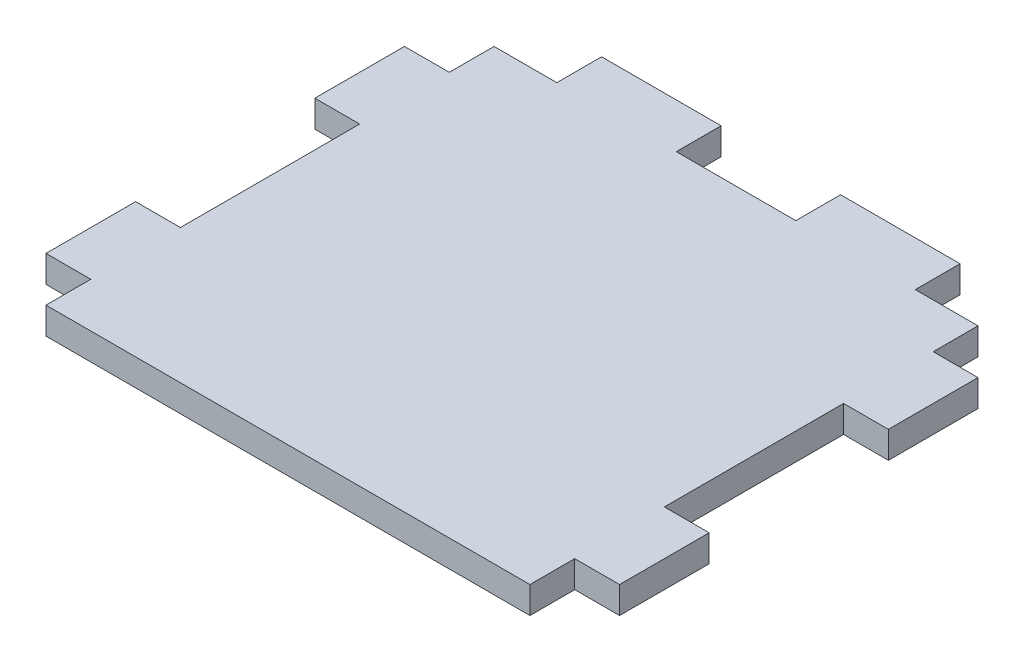
ISO-10303-21;
HEADER;
FILE_DESCRIPTION(('STEP AP214'),'2;1');
FILE_NAME('part.step','',(''),(''),'','','');
FILE_SCHEMA(('AUTOMOTIVE_DESIGN { 1 0 10303 214 1 1 1 1 }'));
ENDSEC;
DATA;
#1=APPLICATION_CONTEXT('core data for automotive mechanical design processes');
#2=APPLICATION_PROTOCOL_DEFINITION('international standard','automotive_design',2000,#1);
#3=PRODUCT_CONTEXT('',#1,'mechanical');
#4=PRODUCT('Part','Part','',(#3));
#5=PRODUCT_RELATED_PRODUCT_CATEGORY('part','',(#4));
#6=PRODUCT_DEFINITION_FORMATION('','',#4);
#7=PRODUCT_DEFINITION_CONTEXT('part definition',#1,'design');
#8=PRODUCT_DEFINITION('design','',#6,#7);
#9=PRODUCT_DEFINITION_SHAPE('','',#8);
#10=(LENGTH_UNIT() NAMED_UNIT(*) SI_UNIT(.MILLI.,.METRE.));
#11=(NAMED_UNIT(*) PLANE_ANGLE_UNIT() SI_UNIT($,.RADIAN.));
#12=(NAMED_UNIT(*) SI_UNIT($,.STERADIAN.) SOLID_ANGLE_UNIT());
#13=UNCERTAINTY_MEASURE_WITH_UNIT(LENGTH_MEASURE(1.E-05),#10,'distance_accuracy_value','');
#14=(GEOMETRIC_REPRESENTATION_CONTEXT(3) GLOBAL_UNCERTAINTY_ASSIGNED_CONTEXT((#13)) GLOBAL_UNIT_ASSIGNED_CONTEXT((#10,
#11,#12)) REPRESENTATION_CONTEXT('',''));
#15=CARTESIAN_POINT('',(0.,0.,0.));
#16=DIRECTION('',(0.,0.,1.));
#17=DIRECTION('',(1.,0.,0.));
#18=AXIS2_PLACEMENT_3D('',#15,#16,#17);
#19=CARTESIAN_POINT('',(1.04083408558609E-13,4.5,-37.5000000000001));
#20=DIRECTION('',(0.,0.,-1.));
#21=DIRECTION('',(-1.,0.,0.));
#22=AXIS2_PLACEMENT_3D('',#19,#20,#21);
#23=PLANE('',#22);
#24=DIRECTION('',(1.,0.,0.));
#25=VECTOR('',#24,1.);
#26=CARTESIAN_POINT('',(1.04083408558609E-13,0.,-37.5000000000001));
#27=LINE('',#26,#25);
#28=CARTESIAN_POINT('',(30.,0.,-37.5));
#29=VERTEX_POINT('',#28);
#30=CARTESIAN_POINT('',(40.5,0.,-37.5));
#31=VERTEX_POINT('',#30);
#32=EDGE_CURVE('E248',#29,#31,#27,.T.);
#33=ORIENTED_EDGE('',*,*,#32,.F.);
#34=DIRECTION('',(0.,-1.,0.));
#35=VECTOR('',#34,1.);
#36=CARTESIAN_POINT('',(30.,4.5,-37.5));
#37=LINE('',#36,#35);
#38=CARTESIAN_POINT('',(30.,4.5,-37.5));
#39=VERTEX_POINT('',#38);
#40=EDGE_CURVE('E11',#39,#29,#37,.T.);
#41=ORIENTED_EDGE('',*,*,#40,.F.);
#42=DIRECTION('',(1.,0.,0.));
#43=VECTOR('',#42,1.);
#44=CARTESIAN_POINT('',(1.04083408558609E-13,4.5,-37.5000000000001));
#45=LINE('',#44,#43);
#46=CARTESIAN_POINT('',(40.5,4.5,-37.5));
#47=VERTEX_POINT('',#46);
#48=EDGE_CURVE('E322',#39,#47,#45,.T.);
#49=ORIENTED_EDGE('',*,*,#48,.T.);
#50=DIRECTION('',(0.,-1.,0.));
#51=VECTOR('',#50,1.);
#52=CARTESIAN_POINT('',(40.5,4.5,-37.5));
#53=LINE('',#52,#51);
#54=EDGE_CURVE('E49',#47,#31,#53,.T.);
#55=ORIENTED_EDGE('',*,*,#54,.T.);
#56=EDGE_LOOP('',(#33,#41,#49,#55));
#57=FACE_BOUND('',#56,.T.);
#58=ADVANCED_FACE('F33',(#57),#23,.T.);
#59=CARTESIAN_POINT('',(30.0000000000001,4.5,0.));
#60=DIRECTION('',(1.,0.,0.));
#61=DIRECTION('',(0.,0.,-1.));
#62=AXIS2_PLACEMENT_3D('',#59,#60,#61);
#63=PLANE('',#62);
#64=DIRECTION('',(0.,0.,1.));
#65=VECTOR('',#64,1.);
#66=CARTESIAN_POINT('',(30.0000000000001,0.,0.));
#67=LINE('',#66,#65);
#68=CARTESIAN_POINT('',(30.,0.,-45.));
#69=VERTEX_POINT('',#68);
#70=EDGE_CURVE('E250',#69,#29,#67,.T.);
#71=ORIENTED_EDGE('',*,*,#70,.F.);
#72=DIRECTION('',(0.,-1.,0.));
#73=VECTOR('',#72,1.);
#74=CARTESIAN_POINT('',(30.,4.5,-45.));
#75=LINE('',#74,#73);
#76=CARTESIAN_POINT('',(30.,4.5,-45.));
#77=VERTEX_POINT('',#76);
#78=EDGE_CURVE('E41',#77,#69,#75,.T.);
#79=ORIENTED_EDGE('',*,*,#78,.F.);
#80=DIRECTION('',(0.,0.,1.));
#81=VECTOR('',#80,1.);
#82=CARTESIAN_POINT('',(30.0000000000001,4.5,0.));
#83=LINE('',#82,#81);
#84=EDGE_CURVE('E389',#77,#39,#83,.T.);
#85=ORIENTED_EDGE('',*,*,#84,.T.);
#86=ORIENTED_EDGE('',*,*,#40,.T.);
#87=EDGE_LOOP('',(#71,#79,#85,#86));
#88=FACE_BOUND('',#87,.T.);
#89=ADVANCED_FACE('F388',(#88),#63,.T.);
#90=CARTESIAN_POINT('',(0.,4.5,-45.));
#91=DIRECTION('',(0.,0.,1.));
#92=DIRECTION('',(1.,0.,0.));
#93=AXIS2_PLACEMENT_3D('',#90,#91,#92);
#94=PLANE('',#93);
#95=DIRECTION('',(-1.,0.,0.));
#96=VECTOR('',#95,1.);
#97=CARTESIAN_POINT('',(0.,0.,-45.));
#98=LINE('',#97,#96);
#99=CARTESIAN_POINT('',(9.99999999999997,0.,-45.));
#100=VERTEX_POINT('',#99);
#101=EDGE_CURVE('E253',#69,#100,#98,.T.);
#102=ORIENTED_EDGE('',*,*,#101,.T.);
#103=DIRECTION('',(0.,-1.,0.));
#104=VECTOR('',#103,1.);
#105=CARTESIAN_POINT('',(9.99999999999997,4.5,-45.));
#106=LINE('',#105,#104);
#107=CARTESIAN_POINT('',(9.99999999999997,4.5,-45.));
#108=VERTEX_POINT('',#107);
#109=EDGE_CURVE('E373',#108,#100,#106,.T.);
#110=ORIENTED_EDGE('',*,*,#109,.F.);
#111=DIRECTION('',(-1.,0.,0.));
#112=VECTOR('',#111,1.);
#113=CARTESIAN_POINT('',(0.,4.5,-45.));
#114=LINE('',#113,#112);
#115=EDGE_CURVE('E380',#77,#108,#114,.T.);
#116=ORIENTED_EDGE('',*,*,#115,.F.);
#117=ORIENTED_EDGE('',*,*,#78,.T.);
#118=EDGE_LOOP('',(#102,#110,#116,#117));
#119=FACE_BOUND('',#118,.T.);
#120=ADVANCED_FACE('F378',(#119),#94,.F.);
#121=CARTESIAN_POINT('',(10.,4.5,0.));
#122=DIRECTION('',(1.,0.,0.));
#123=DIRECTION('',(0.,0.,-1.));
#124=AXIS2_PLACEMENT_3D('',#121,#122,#123);
#125=PLANE('',#124);
#126=DIRECTION('',(0.,0.,1.));
#127=VECTOR('',#126,1.);
#128=CARTESIAN_POINT('',(10.,0.,0.));
#129=LINE('',#128,#127);
#130=CARTESIAN_POINT('',(9.99999999999998,0.,-37.5));
#131=VERTEX_POINT('',#130);
#132=EDGE_CURVE('E255',#100,#131,#129,.T.);
#133=ORIENTED_EDGE('',*,*,#132,.T.);
#134=DIRECTION('',(0.,-1.,0.));
#135=VECTOR('',#134,1.);
#136=CARTESIAN_POINT('',(9.99999999999998,4.5,-37.5));
#137=LINE('',#136,#135);
#138=CARTESIAN_POINT('',(9.99999999999998,4.5,-37.5));
#139=VERTEX_POINT('',#138);
#140=EDGE_CURVE('E371',#139,#131,#137,.T.);
#141=ORIENTED_EDGE('',*,*,#140,.F.);
#142=DIRECTION('',(0.,0.,1.));
#143=VECTOR('',#142,1.);
#144=CARTESIAN_POINT('',(10.,4.5,0.));
#145=LINE('',#144,#143);
#146=EDGE_CURVE('E752',#108,#139,#145,.T.);
#147=ORIENTED_EDGE('',*,*,#146,.F.);
#148=ORIENTED_EDGE('',*,*,#109,.T.);
#149=EDGE_LOOP('',(#133,#141,#147,#148));
#150=FACE_BOUND('',#149,.T.);
#151=ADVANCED_FACE('F407',(#150),#125,.F.);
#152=CARTESIAN_POINT('',(0.,4.5,-37.5));
#153=DIRECTION('',(0.,0.,-1.));
#154=DIRECTION('',(-1.,0.,0.));
#155=AXIS2_PLACEMENT_3D('',#152,#153,#154);
#156=PLANE('',#155);
#157=DIRECTION('',(1.,0.,0.));
#158=VECTOR('',#157,1.);
#159=CARTESIAN_POINT('',(0.,0.,-37.5));
#160=LINE('',#159,#158);
#161=CARTESIAN_POINT('',(-9.99999999999998,0.,-37.5));
#162=VERTEX_POINT('',#161);
#163=EDGE_CURVE('E258',#162,#131,#160,.T.);
#164=ORIENTED_EDGE('',*,*,#163,.F.);
#165=DIRECTION('',(0.,-1.,0.));
#166=VECTOR('',#165,1.);
#167=CARTESIAN_POINT('',(-9.99999999999998,4.5,-37.5));
#168=LINE('',#167,#166);
#169=CARTESIAN_POINT('',(-9.99999999999998,4.5,-37.5));
#170=VERTEX_POINT('',#169);
#171=EDGE_CURVE('E369',#170,#162,#168,.T.);
#172=ORIENTED_EDGE('',*,*,#171,.F.);
#173=DIRECTION('',(1.,0.,0.));
#174=VECTOR('',#173,1.);
#175=CARTESIAN_POINT('',(0.,4.5,-37.5));
#176=LINE('',#175,#174);
#177=EDGE_CURVE('E750',#170,#139,#176,.T.);
#178=ORIENTED_EDGE('',*,*,#177,.T.);
#179=ORIENTED_EDGE('',*,*,#140,.T.);
#180=EDGE_LOOP('',(#164,#172,#178,#179));
#181=FACE_BOUND('',#180,.T.);
#182=ADVANCED_FACE('F412',(#181),#156,.T.);
#183=CARTESIAN_POINT('',(-9.99999999999997,4.5,0.));
#184=DIRECTION('',(1.,0.,0.));
#185=DIRECTION('',(0.,0.,-1.));
#186=AXIS2_PLACEMENT_3D('',#183,#184,#185);
#187=PLANE('',#186);
#188=DIRECTION('',(0.,0.,1.));
#189=VECTOR('',#188,1.);
#190=CARTESIAN_POINT('',(-9.99999999999997,0.,0.));
#191=LINE('',#190,#189);
#192=CARTESIAN_POINT('',(-9.99999999999998,0.,-45.));
#193=VERTEX_POINT('',#192);
#194=EDGE_CURVE('E261',#193,#162,#191,.T.);
#195=ORIENTED_EDGE('',*,*,#194,.F.);
#196=DIRECTION('',(0.,-1.,0.));
#197=VECTOR('',#196,1.);
#198=CARTESIAN_POINT('',(-9.99999999999998,4.5,-45.));
#199=LINE('',#198,#197);
#200=CARTESIAN_POINT('',(-9.99999999999998,4.5,-45.));
#201=VERTEX_POINT('',#200);
#202=EDGE_CURVE('E367',#201,#193,#199,.T.);
#203=ORIENTED_EDGE('',*,*,#202,.F.);
#204=DIRECTION('',(0.,0.,1.));
#205=VECTOR('',#204,1.);
#206=CARTESIAN_POINT('',(-9.99999999999997,4.5,0.));
#207=LINE('',#206,#205);
#208=EDGE_CURVE('E754',#201,#170,#207,.T.);
#209=ORIENTED_EDGE('',*,*,#208,.T.);
#210=ORIENTED_EDGE('',*,*,#171,.T.);
#211=EDGE_LOOP('',(#195,#203,#209,#210));
#212=FACE_BOUND('',#211,.T.);
#213=ADVANCED_FACE('F416',(#212),#187,.T.);
#214=CARTESIAN_POINT('',(0.,4.5,-45.));
#215=DIRECTION('',(0.,0.,-1.));
#216=DIRECTION('',(-1.,0.,0.));
#217=AXIS2_PLACEMENT_3D('',#214,#215,#216);
#218=PLANE('',#217);
#219=DIRECTION('',(1.,0.,0.));
#220=VECTOR('',#219,1.);
#221=CARTESIAN_POINT('',(0.,0.,-45.));
#222=LINE('',#221,#220);
#223=CARTESIAN_POINT('',(-30.,0.,-45.));
#224=VERTEX_POINT('',#223);
#225=EDGE_CURVE('E264',#224,#193,#222,.T.);
#226=ORIENTED_EDGE('',*,*,#225,.F.);
#227=DIRECTION('',(0.,-1.,0.));
#228=VECTOR('',#227,1.);
#229=CARTESIAN_POINT('',(-30.,4.5,-45.));
#230=LINE('',#229,#228);
#231=CARTESIAN_POINT('',(-30.,4.5,-45.));
#232=VERTEX_POINT('',#231);
#233=EDGE_CURVE('E365',#232,#224,#230,.T.);
#234=ORIENTED_EDGE('',*,*,#233,.F.);
#235=DIRECTION('',(1.,0.,0.));
#236=VECTOR('',#235,1.);
#237=CARTESIAN_POINT('',(0.,4.5,-45.));
#238=LINE('',#237,#236);
#239=EDGE_CURVE('E743',#232,#201,#238,.T.);
#240=ORIENTED_EDGE('',*,*,#239,.T.);
#241=ORIENTED_EDGE('',*,*,#202,.T.);
#242=EDGE_LOOP('',(#226,#234,#240,#241));
#243=FACE_BOUND('',#242,.T.);
#244=ADVANCED_FACE('F420',(#243),#218,.T.);
#245=CARTESIAN_POINT('',(-30.,4.5,0.));
#246=DIRECTION('',(1.,0.,0.));
#247=DIRECTION('',(0.,0.,-1.));
#248=AXIS2_PLACEMENT_3D('',#245,#246,#247);
#249=PLANE('',#248);
#250=DIRECTION('',(0.,0.,1.));
#251=VECTOR('',#250,1.);
#252=CARTESIAN_POINT('',(-30.,0.,0.));
#253=LINE('',#252,#251);
#254=CARTESIAN_POINT('',(-30.,0.,-37.5));
#255=VERTEX_POINT('',#254);
#256=EDGE_CURVE('E267',#224,#255,#253,.T.);
#257=ORIENTED_EDGE('',*,*,#256,.T.);
#258=DIRECTION('',(0.,-1.,0.));
#259=VECTOR('',#258,1.);
#260=CARTESIAN_POINT('',(-30.,4.5,-37.5));
#261=LINE('',#260,#259);
#262=CARTESIAN_POINT('',(-30.,4.5,-37.5));
#263=VERTEX_POINT('',#262);
#264=EDGE_CURVE('E363',#263,#255,#261,.T.);
#265=ORIENTED_EDGE('',*,*,#264,.F.);
#266=DIRECTION('',(0.,0.,1.));
#267=VECTOR('',#266,1.);
#268=CARTESIAN_POINT('',(-30.,4.5,0.));
#269=LINE('',#268,#267);
#270=EDGE_CURVE('E761',#232,#263,#269,.T.);
#271=ORIENTED_EDGE('',*,*,#270,.F.);
#272=ORIENTED_EDGE('',*,*,#233,.T.);
#273=EDGE_LOOP('',(#257,#265,#271,#272));
#274=FACE_BOUND('',#273,.T.);
#275=ADVANCED_FACE('F424',(#274),#249,.F.);
#276=CARTESIAN_POINT('',(0.,4.5,-37.5));
#277=DIRECTION('',(0.,0.,-1.));
#278=DIRECTION('',(-1.,0.,0.));
#279=AXIS2_PLACEMENT_3D('',#276,#277,#278);
#280=PLANE('',#279);
#281=DIRECTION('',(1.,0.,0.));
#282=VECTOR('',#281,1.);
#283=CARTESIAN_POINT('',(0.,0.,-37.5));
#284=LINE('',#283,#282);
#285=CARTESIAN_POINT('',(-40.5,0.,-37.5));
#286=VERTEX_POINT('',#285);
#287=EDGE_CURVE('E270',#286,#255,#284,.T.);
#288=ORIENTED_EDGE('',*,*,#287,.F.);
#289=DIRECTION('',(0.,-1.,0.));
#290=VECTOR('',#289,1.);
#291=CARTESIAN_POINT('',(-40.5,4.5,-37.5));
#292=LINE('',#291,#290);
#293=CARTESIAN_POINT('',(-40.5,4.5,-37.5));
#294=VERTEX_POINT('',#293);
#295=EDGE_CURVE('E361',#294,#286,#292,.T.);
#296=ORIENTED_EDGE('',*,*,#295,.F.);
#297=DIRECTION('',(1.,0.,0.));
#298=VECTOR('',#297,1.);
#299=CARTESIAN_POINT('',(0.,4.5,-37.5));
#300=LINE('',#299,#298);
#301=EDGE_CURVE('E737',#294,#263,#300,.T.);
#302=ORIENTED_EDGE('',*,*,#301,.T.);
#303=ORIENTED_EDGE('',*,*,#264,.T.);
#304=EDGE_LOOP('',(#288,#296,#302,#303));
#305=FACE_BOUND('',#304,.T.);
#306=ADVANCED_FACE('F428',(#305),#280,.T.);
#307=CARTESIAN_POINT('',(-40.4999999999999,4.5,0.));
#308=DIRECTION('',(1.,0.,0.));
#309=DIRECTION('',(0.,0.,-1.));
#310=AXIS2_PLACEMENT_3D('',#307,#308,#309);
#311=PLANE('',#310);
#312=DIRECTION('',(0.,0.,1.));
#313=VECTOR('',#312,1.);
#314=CARTESIAN_POINT('',(-40.4999999999999,0.,0.));
#315=LINE('',#314,#313);
#316=CARTESIAN_POINT('',(-40.5,0.,-30.));
#317=VERTEX_POINT('',#316);
#318=EDGE_CURVE('E273',#286,#317,#315,.T.);
#319=ORIENTED_EDGE('',*,*,#318,.T.);
#320=DIRECTION('',(0.,-1.,0.));
#321=VECTOR('',#320,1.);
#322=CARTESIAN_POINT('',(-40.5,4.5,-30.));
#323=LINE('',#322,#321);
#324=CARTESIAN_POINT('',(-40.5,4.5,-30.));
#325=VERTEX_POINT('',#324);
#326=EDGE_CURVE('E359',#325,#317,#323,.T.);
#327=ORIENTED_EDGE('',*,*,#326,.F.);
#328=DIRECTION('',(0.,0.,1.));
#329=VECTOR('',#328,1.);
#330=CARTESIAN_POINT('',(-40.4999999999999,4.5,0.));
#331=LINE('',#330,#329);
#332=EDGE_CURVE('E764',#294,#325,#331,.T.);
#333=ORIENTED_EDGE('',*,*,#332,.F.);
#334=ORIENTED_EDGE('',*,*,#295,.T.);
#335=EDGE_LOOP('',(#319,#327,#333,#334));
#336=FACE_BOUND('',#335,.T.);
#337=ADVANCED_FACE('F432',(#336),#311,.F.);
#338=CARTESIAN_POINT('',(0.,4.5,-30.));
#339=DIRECTION('',(0.,0.,-1.));
#340=DIRECTION('',(-1.,0.,0.));
#341=AXIS2_PLACEMENT_3D('',#338,#339,#340);
#342=PLANE('',#341);
#343=DIRECTION('',(1.,0.,0.));
#344=VECTOR('',#343,1.);
#345=CARTESIAN_POINT('',(0.,0.,-30.));
#346=LINE('',#345,#344);
#347=CARTESIAN_POINT('',(-48.,0.,-30.));
#348=VERTEX_POINT('',#347);
#349=EDGE_CURVE('E276',#348,#317,#346,.T.);
#350=ORIENTED_EDGE('',*,*,#349,.F.);
#351=DIRECTION('',(0.,-1.,0.));
#352=VECTOR('',#351,1.);
#353=CARTESIAN_POINT('',(-48.,4.5,-30.));
#354=LINE('',#353,#352);
#355=CARTESIAN_POINT('',(-48.,4.5,-30.));
#356=VERTEX_POINT('',#355);
#357=EDGE_CURVE('E357',#356,#348,#354,.T.);
#358=ORIENTED_EDGE('',*,*,#357,.F.);
#359=DIRECTION('',(1.,0.,0.));
#360=VECTOR('',#359,1.);
#361=CARTESIAN_POINT('',(0.,4.5,-30.));
#362=LINE('',#361,#360);
#363=EDGE_CURVE('E730',#356,#325,#362,.T.);
#364=ORIENTED_EDGE('',*,*,#363,.T.);
#365=ORIENTED_EDGE('',*,*,#326,.T.);
#366=EDGE_LOOP('',(#350,#358,#364,#365));
#367=FACE_BOUND('',#366,.T.);
#368=ADVANCED_FACE('F436',(#367),#342,.T.);
#369=CARTESIAN_POINT('',(-48.,4.5,0.));
#370=DIRECTION('',(1.,0.,0.));
#371=DIRECTION('',(0.,0.,-1.));
#372=AXIS2_PLACEMENT_3D('',#369,#370,#371);
#373=PLANE('',#372);
#374=DIRECTION('',(0.,0.,1.));
#375=VECTOR('',#374,1.);
#376=CARTESIAN_POINT('',(-48.,0.,0.));
#377=LINE('',#376,#375);
#378=CARTESIAN_POINT('',(-48.,0.,-15.));
#379=VERTEX_POINT('',#378);
#380=EDGE_CURVE('E279',#348,#379,#377,.T.);
#381=ORIENTED_EDGE('',*,*,#380,.T.);
#382=DIRECTION('',(0.,-1.,0.));
#383=VECTOR('',#382,1.);
#384=CARTESIAN_POINT('',(-48.,4.5,-15.));
#385=LINE('',#384,#383);
#386=CARTESIAN_POINT('',(-48.,4.5,-15.));
#387=VERTEX_POINT('',#386);
#388=EDGE_CURVE('E354',#387,#379,#385,.T.);
#389=ORIENTED_EDGE('',*,*,#388,.F.);
#390=DIRECTION('',(0.,0.,1.));
#391=VECTOR('',#390,1.);
#392=CARTESIAN_POINT('',(-48.,4.5,0.));
#393=LINE('',#392,#391);
#394=EDGE_CURVE('E724',#356,#387,#393,.T.);
#395=ORIENTED_EDGE('',*,*,#394,.F.);
#396=ORIENTED_EDGE('',*,*,#357,.T.);
#397=EDGE_LOOP('',(#381,#389,#395,#396));
#398=FACE_BOUND('',#397,.T.);
#399=ADVANCED_FACE('F440',(#398),#373,.F.);
#400=CARTESIAN_POINT('',(0.,4.5,-15.));
#401=DIRECTION('',(0.,0.,-1.));
#402=DIRECTION('',(-1.,0.,0.));
#403=AXIS2_PLACEMENT_3D('',#400,#401,#402);
#404=PLANE('',#403);
#405=DIRECTION('',(1.,0.,0.));
#406=VECTOR('',#405,1.);
#407=CARTESIAN_POINT('',(0.,0.,-15.));
#408=LINE('',#407,#406);
#409=CARTESIAN_POINT('',(-40.5,0.,-15.));
#410=VERTEX_POINT('',#409);
#411=EDGE_CURVE('E281',#379,#410,#408,.T.);
#412=ORIENTED_EDGE('',*,*,#411,.T.);
#413=DIRECTION('',(0.,-1.,0.));
#414=VECTOR('',#413,1.);
#415=CARTESIAN_POINT('',(-40.5,4.5,-15.));
#416=LINE('',#415,#414);
#417=CARTESIAN_POINT('',(-40.5,4.5,-15.));
#418=VERTEX_POINT('',#417);
#419=EDGE_CURVE('E351',#418,#410,#416,.T.);
#420=ORIENTED_EDGE('',*,*,#419,.F.);
#421=DIRECTION('',(1.,0.,0.));
#422=VECTOR('',#421,1.);
#423=CARTESIAN_POINT('',(0.,4.5,-15.));
#424=LINE('',#423,#422);
#425=EDGE_CURVE('E721',#387,#418,#424,.T.);
#426=ORIENTED_EDGE('',*,*,#425,.F.);
#427=ORIENTED_EDGE('',*,*,#388,.T.);
#428=EDGE_LOOP('',(#412,#420,#426,#427));
#429=FACE_BOUND('',#428,.T.);
#430=ADVANCED_FACE('F444',(#429),#404,.F.);
#431=CARTESIAN_POINT('',(-40.5,4.5,0.));
#432=DIRECTION('',(1.,0.,0.));
#433=DIRECTION('',(0.,0.,-1.));
#434=AXIS2_PLACEMENT_3D('',#431,#432,#433);
#435=PLANE('',#434);
#436=DIRECTION('',(0.,0.,1.));
#437=VECTOR('',#436,1.);
#438=CARTESIAN_POINT('',(-40.5,0.,0.));
#439=LINE('',#438,#437);
#440=CARTESIAN_POINT('',(-40.5,0.,15.));
#441=VERTEX_POINT('',#440);
#442=EDGE_CURVE('E283',#410,#441,#439,.T.);
#443=ORIENTED_EDGE('',*,*,#442,.T.);
#444=DIRECTION('',(0.,-1.,0.));
#445=VECTOR('',#444,1.);
#446=CARTESIAN_POINT('',(-40.5,4.5,15.));
#447=LINE('',#446,#445);
#448=CARTESIAN_POINT('',(-40.5,4.5,15.));
#449=VERTEX_POINT('',#448);
#450=EDGE_CURVE('E349',#449,#441,#447,.T.);
#451=ORIENTED_EDGE('',*,*,#450,.F.);
#452=DIRECTION('',(0.,0.,1.));
#453=VECTOR('',#452,1.);
#454=CARTESIAN_POINT('',(-40.5,4.5,0.));
#455=LINE('',#454,#453);
#456=EDGE_CURVE('E719',#418,#449,#455,.T.);
#457=ORIENTED_EDGE('',*,*,#456,.F.);
#458=ORIENTED_EDGE('',*,*,#419,.T.);
#459=EDGE_LOOP('',(#443,#451,#457,#458));
#460=FACE_BOUND('',#459,.T.);
#461=ADVANCED_FACE('F448',(#460),#435,.F.);
#462=CARTESIAN_POINT('',(0.,4.5,15.));
#463=DIRECTION('',(0.,0.,-1.));
#464=DIRECTION('',(-1.,0.,0.));
#465=AXIS2_PLACEMENT_3D('',#462,#463,#464);
#466=PLANE('',#465);
#467=DIRECTION('',(1.,0.,0.));
#468=VECTOR('',#467,1.);
#469=CARTESIAN_POINT('',(0.,0.,15.));
#470=LINE('',#469,#468);
#471=CARTESIAN_POINT('',(-48.,0.,15.));
#472=VERTEX_POINT('',#471);
#473=EDGE_CURVE('E286',#472,#441,#470,.T.);
#474=ORIENTED_EDGE('',*,*,#473,.F.);
#475=DIRECTION('',(0.,-1.,0.));
#476=VECTOR('',#475,1.);
#477=CARTESIAN_POINT('',(-48.,4.5,15.));
#478=LINE('',#477,#476);
#479=CARTESIAN_POINT('',(-48.,4.5,15.));
#480=VERTEX_POINT('',#479);
#481=EDGE_CURVE('E347',#480,#472,#478,.T.);
#482=ORIENTED_EDGE('',*,*,#481,.F.);
#483=DIRECTION('',(1.,0.,0.));
#484=VECTOR('',#483,1.);
#485=CARTESIAN_POINT('',(0.,4.5,15.));
#486=LINE('',#485,#484);
#487=EDGE_CURVE('E770',#480,#449,#486,.T.);
#488=ORIENTED_EDGE('',*,*,#487,.T.);
#489=ORIENTED_EDGE('',*,*,#450,.T.);
#490=EDGE_LOOP('',(#474,#482,#488,#489));
#491=FACE_BOUND('',#490,.T.);
#492=ADVANCED_FACE('F452',(#491),#466,.T.);
#493=CARTESIAN_POINT('',(-48.,4.5,0.));
#494=DIRECTION('',(-1.,0.,0.));
#495=DIRECTION('',(0.,0.,1.));
#496=AXIS2_PLACEMENT_3D('',#493,#494,#495);
#497=PLANE('',#496);
#498=DIRECTION('',(0.,0.,-1.));
#499=VECTOR('',#498,1.);
#500=CARTESIAN_POINT('',(-48.,0.,0.));
#501=LINE('',#500,#499);
#502=CARTESIAN_POINT('',(-48.,0.,30.));
#503=VERTEX_POINT('',#502);
#504=EDGE_CURVE('E289',#503,#472,#501,.T.);
#505=ORIENTED_EDGE('',*,*,#504,.F.);
#506=DIRECTION('',(0.,-1.,0.));
#507=VECTOR('',#506,1.);
#508=CARTESIAN_POINT('',(-48.,4.5,30.));
#509=LINE('',#508,#507);
#510=CARTESIAN_POINT('',(-48.,4.5,30.));
#511=VERTEX_POINT('',#510);
#512=EDGE_CURVE('E345',#511,#503,#509,.T.);
#513=ORIENTED_EDGE('',*,*,#512,.F.);
#514=DIRECTION('',(0.,0.,-1.));
#515=VECTOR('',#514,1.);
#516=CARTESIAN_POINT('',(-48.,4.5,0.));
#517=LINE('',#516,#515);
#518=EDGE_CURVE('E710',#511,#480,#517,.T.);
#519=ORIENTED_EDGE('',*,*,#518,.T.);
#520=ORIENTED_EDGE('',*,*,#481,.T.);
#521=EDGE_LOOP('',(#505,#513,#519,#520));
#522=FACE_BOUND('',#521,.T.);
#523=ADVANCED_FACE('F456',(#522),#497,.T.);
#524=CARTESIAN_POINT('',(0.,4.5,30.));
#525=DIRECTION('',(0.,0.,-1.));
#526=DIRECTION('',(-1.,0.,0.));
#527=AXIS2_PLACEMENT_3D('',#524,#525,#526);
#528=PLANE('',#527);
#529=DIRECTION('',(1.,0.,0.));
#530=VECTOR('',#529,1.);
#531=CARTESIAN_POINT('',(0.,0.,30.));
#532=LINE('',#531,#530);
#533=CARTESIAN_POINT('',(-40.5,0.,30.));
#534=VERTEX_POINT('',#533);
#535=EDGE_CURVE('E292',#503,#534,#532,.T.);
#536=ORIENTED_EDGE('',*,*,#535,.T.);
#537=DIRECTION('',(0.,-1.,0.));
#538=VECTOR('',#537,1.);
#539=CARTESIAN_POINT('',(-40.5,4.5,30.));
#540=LINE('',#539,#538);
#541=CARTESIAN_POINT('',(-40.5,4.5,30.));
#542=VERTEX_POINT('',#541);
#543=EDGE_CURVE('E342',#542,#534,#540,.T.);
#544=ORIENTED_EDGE('',*,*,#543,.F.);
#545=DIRECTION('',(1.,0.,0.));
#546=VECTOR('',#545,1.);
#547=CARTESIAN_POINT('',(0.,4.5,30.));
#548=LINE('',#547,#546);
#549=EDGE_CURVE('E705',#511,#542,#548,.T.);
#550=ORIENTED_EDGE('',*,*,#549,.F.);
#551=ORIENTED_EDGE('',*,*,#512,.T.);
#552=EDGE_LOOP('',(#536,#544,#550,#551));
#553=FACE_BOUND('',#552,.T.);
#554=ADVANCED_FACE('F460',(#553),#528,.F.);
#555=CARTESIAN_POINT('',(-40.5,4.5,0.));
#556=DIRECTION('',(1.,0.,0.));
#557=DIRECTION('',(0.,0.,-1.));
#558=AXIS2_PLACEMENT_3D('',#555,#556,#557);
#559=PLANE('',#558);
#560=DIRECTION('',(0.,0.,1.));
#561=VECTOR('',#560,1.);
#562=CARTESIAN_POINT('',(-40.5,0.,0.));
#563=LINE('',#562,#561);
#564=CARTESIAN_POINT('',(-40.5,0.,37.5));
#565=VERTEX_POINT('',#564);
#566=EDGE_CURVE('E294',#534,#565,#563,.T.);
#567=ORIENTED_EDGE('',*,*,#566,.T.);
#568=DIRECTION('',(0.,-1.,0.));
#569=VECTOR('',#568,1.);
#570=CARTESIAN_POINT('',(-40.5,4.5,37.5));
#571=LINE('',#570,#569);
#572=CARTESIAN_POINT('',(-40.5,4.5,37.5));
#573=VERTEX_POINT('',#572);
#574=EDGE_CURVE('E339',#573,#565,#571,.T.);
#575=ORIENTED_EDGE('',*,*,#574,.F.);
#576=DIRECTION('',(0.,0.,1.));
#577=VECTOR('',#576,1.);
#578=CARTESIAN_POINT('',(-40.5,4.5,0.));
#579=LINE('',#578,#577);
#580=EDGE_CURVE('E702',#542,#573,#579,.T.);
#581=ORIENTED_EDGE('',*,*,#580,.F.);
#582=ORIENTED_EDGE('',*,*,#543,.T.);
#583=EDGE_LOOP('',(#567,#575,#581,#582));
#584=FACE_BOUND('',#583,.T.);
#585=ADVANCED_FACE('F464',(#584),#559,.F.);
#586=CARTESIAN_POINT('',(0.,4.5,37.5));
#587=DIRECTION('',(0.,0.,-1.));
#588=DIRECTION('',(-1.,0.,0.));
#589=AXIS2_PLACEMENT_3D('',#586,#587,#588);
#590=PLANE('',#589);
#591=DIRECTION('',(1.,0.,0.));
#592=VECTOR('',#591,1.);
#593=CARTESIAN_POINT('',(0.,0.,37.5));
#594=LINE('',#593,#592);
#595=CARTESIAN_POINT('',(40.5000000000001,0.,37.5));
#596=VERTEX_POINT('',#595);
#597=EDGE_CURVE('E296',#565,#596,#594,.T.);
#598=ORIENTED_EDGE('',*,*,#597,.T.);
#599=DIRECTION('',(0.,-1.,0.));
#600=VECTOR('',#599,1.);
#601=CARTESIAN_POINT('',(40.5000000000001,4.5,37.5));
#602=LINE('',#601,#600);
#603=CARTESIAN_POINT('',(40.5000000000001,4.5,37.5));
#604=VERTEX_POINT('',#603);
#605=EDGE_CURVE('E337',#604,#596,#602,.T.);
#606=ORIENTED_EDGE('',*,*,#605,.F.);
#607=DIRECTION('',(1.,0.,0.));
#608=VECTOR('',#607,1.);
#609=CARTESIAN_POINT('',(0.,4.5,37.5));
#610=LINE('',#609,#608);
#611=EDGE_CURVE('E700',#573,#604,#610,.T.);
#612=ORIENTED_EDGE('',*,*,#611,.F.);
#613=ORIENTED_EDGE('',*,*,#574,.T.);
#614=EDGE_LOOP('',(#598,#606,#612,#613));
#615=FACE_BOUND('',#614,.T.);
#616=ADVANCED_FACE('F468',(#615),#590,.F.);
#617=CARTESIAN_POINT('',(40.5000000000001,4.5,0.));
#618=DIRECTION('',(1.,0.,0.));
#619=DIRECTION('',(0.,0.,-1.));
#620=AXIS2_PLACEMENT_3D('',#617,#618,#619);
#621=PLANE('',#620);
#622=DIRECTION('',(0.,0.,1.));
#623=VECTOR('',#622,1.);
#624=CARTESIAN_POINT('',(40.5000000000001,0.,0.));
#625=LINE('',#624,#623);
#626=CARTESIAN_POINT('',(40.5000000000001,0.,29.9999999999999));
#627=VERTEX_POINT('',#626);
#628=EDGE_CURVE('E299',#627,#596,#625,.T.);
#629=ORIENTED_EDGE('',*,*,#628,.F.);
#630=DIRECTION('',(0.,-1.,0.));
#631=VECTOR('',#630,1.);
#632=CARTESIAN_POINT('',(40.5000000000001,4.5,29.9999999999999));
#633=LINE('',#632,#631);
#634=CARTESIAN_POINT('',(40.5000000000001,4.5,29.9999999999999));
#635=VERTEX_POINT('',#634);
#636=EDGE_CURVE('E335',#635,#627,#633,.T.);
#637=ORIENTED_EDGE('',*,*,#636,.F.);
#638=DIRECTION('',(0.,0.,1.));
#639=VECTOR('',#638,1.);
#640=CARTESIAN_POINT('',(40.5000000000001,4.5,0.));
#641=LINE('',#640,#639);
#642=EDGE_CURVE('E776',#635,#604,#641,.T.);
#643=ORIENTED_EDGE('',*,*,#642,.T.);
#644=ORIENTED_EDGE('',*,*,#605,.T.);
#645=EDGE_LOOP('',(#629,#637,#643,#644));
#646=FACE_BOUND('',#645,.T.);
#647=ADVANCED_FACE('F472',(#646),#621,.T.);
#648=CARTESIAN_POINT('',(0.,4.5,30.));
#649=DIRECTION('',(0.,0.,1.));
#650=DIRECTION('',(1.,0.,0.));
#651=AXIS2_PLACEMENT_3D('',#648,#649,#650);
#652=PLANE('',#651);
#653=DIRECTION('',(-1.,0.,0.));
#654=VECTOR('',#653,1.);
#655=CARTESIAN_POINT('',(0.,0.,30.));
#656=LINE('',#655,#654);
#657=CARTESIAN_POINT('',(48.0000000000001,0.,29.9999999999999));
#658=VERTEX_POINT('',#657);
#659=EDGE_CURVE('E302',#658,#627,#656,.T.);
#660=ORIENTED_EDGE('',*,*,#659,.F.);
#661=DIRECTION('',(0.,-1.,0.));
#662=VECTOR('',#661,1.);
#663=CARTESIAN_POINT('',(48.0000000000001,4.5,29.9999999999999));
#664=LINE('',#663,#662);
#665=CARTESIAN_POINT('',(48.0000000000001,4.5,29.9999999999999));
#666=VERTEX_POINT('',#665);
#667=EDGE_CURVE('E333',#666,#658,#664,.T.);
#668=ORIENTED_EDGE('',*,*,#667,.F.);
#669=DIRECTION('',(-1.,0.,0.));
#670=VECTOR('',#669,1.);
#671=CARTESIAN_POINT('',(0.,4.5,30.));
#672=LINE('',#671,#670);
#673=EDGE_CURVE('E691',#666,#635,#672,.T.);
#674=ORIENTED_EDGE('',*,*,#673,.T.);
#675=ORIENTED_EDGE('',*,*,#636,.T.);
#676=EDGE_LOOP('',(#660,#668,#674,#675));
#677=FACE_BOUND('',#676,.T.);
#678=ADVANCED_FACE('F476',(#677),#652,.T.);
#679=CARTESIAN_POINT('',(48.,4.5,0.));
#680=DIRECTION('',(-1.,0.,0.));
#681=DIRECTION('',(0.,0.,1.));
#682=AXIS2_PLACEMENT_3D('',#679,#680,#681);
#683=PLANE('',#682);
#684=DIRECTION('',(0.,0.,-1.));
#685=VECTOR('',#684,1.);
#686=CARTESIAN_POINT('',(48.,0.,0.));
#687=LINE('',#686,#685);
#688=CARTESIAN_POINT('',(48.0000000000001,0.,14.9999999999999));
#689=VERTEX_POINT('',#688);
#690=EDGE_CURVE('E305',#658,#689,#687,.T.);
#691=ORIENTED_EDGE('',*,*,#690,.T.);
#692=DIRECTION('',(0.,-1.,0.));
#693=VECTOR('',#692,1.);
#694=CARTESIAN_POINT('',(48.0000000000001,4.5,14.9999999999999));
#695=LINE('',#694,#693);
#696=CARTESIAN_POINT('',(48.0000000000001,4.5,14.9999999999999));
#697=VERTEX_POINT('',#696);
#698=EDGE_CURVE('E330',#697,#689,#695,.T.);
#699=ORIENTED_EDGE('',*,*,#698,.F.);
#700=DIRECTION('',(0.,0.,-1.));
#701=VECTOR('',#700,1.);
#702=CARTESIAN_POINT('',(48.,4.5,0.));
#703=LINE('',#702,#701);
#704=EDGE_CURVE('E686',#666,#697,#703,.T.);
#705=ORIENTED_EDGE('',*,*,#704,.F.);
#706=ORIENTED_EDGE('',*,*,#667,.T.);
#707=EDGE_LOOP('',(#691,#699,#705,#706));
#708=FACE_BOUND('',#707,.T.);
#709=ADVANCED_FACE('F480',(#708),#683,.F.);
#710=CARTESIAN_POINT('',(0.,4.5,15.));
#711=DIRECTION('',(0.,0.,1.));
#712=DIRECTION('',(1.,0.,0.));
#713=AXIS2_PLACEMENT_3D('',#710,#711,#712);
#714=PLANE('',#713);
#715=DIRECTION('',(-1.,0.,0.));
#716=VECTOR('',#715,1.);
#717=CARTESIAN_POINT('',(0.,0.,15.));
#718=LINE('',#717,#716);
#719=CARTESIAN_POINT('',(40.5000000000001,0.,14.9999999999999));
#720=VERTEX_POINT('',#719);
#721=EDGE_CURVE('E307',#689,#720,#718,.T.);
#722=ORIENTED_EDGE('',*,*,#721,.T.);
#723=DIRECTION('',(0.,-1.,0.));
#724=VECTOR('',#723,1.);
#725=CARTESIAN_POINT('',(40.5000000000001,4.5,14.9999999999999));
#726=LINE('',#725,#724);
#727=CARTESIAN_POINT('',(40.5000000000001,4.5,14.9999999999999));
#728=VERTEX_POINT('',#727);
#729=EDGE_CURVE('E328',#728,#720,#726,.T.);
#730=ORIENTED_EDGE('',*,*,#729,.F.);
#731=DIRECTION('',(-1.,0.,0.));
#732=VECTOR('',#731,1.);
#733=CARTESIAN_POINT('',(0.,4.5,15.));
#734=LINE('',#733,#732);
#735=EDGE_CURVE('E684',#697,#728,#734,.T.);
#736=ORIENTED_EDGE('',*,*,#735,.F.);
#737=ORIENTED_EDGE('',*,*,#698,.T.);
#738=EDGE_LOOP('',(#722,#730,#736,#737));
#739=FACE_BOUND('',#738,.T.);
#740=ADVANCED_FACE('F484',(#739),#714,.F.);
#741=CARTESIAN_POINT('',(40.5,4.5,0.));
#742=DIRECTION('',(1.,0.,0.));
#743=DIRECTION('',(0.,0.,-1.));
#744=AXIS2_PLACEMENT_3D('',#741,#742,#743);
#745=PLANE('',#744);
#746=DIRECTION('',(0.,0.,1.));
#747=VECTOR('',#746,1.);
#748=CARTESIAN_POINT('',(40.5,0.,0.));
#749=LINE('',#748,#747);
#750=CARTESIAN_POINT('',(40.5,0.,-15.0000000000001));
#751=VERTEX_POINT('',#750);
#752=EDGE_CURVE('E310',#751,#720,#749,.T.);
#753=ORIENTED_EDGE('',*,*,#752,.F.);
#754=DIRECTION('',(0.,-1.,0.));
#755=VECTOR('',#754,1.);
#756=CARTESIAN_POINT('',(40.5,4.5,-15.0000000000001));
#757=LINE('',#756,#755);
#758=CARTESIAN_POINT('',(40.5,4.5,-15.0000000000001));
#759=VERTEX_POINT('',#758);
#760=EDGE_CURVE('E326',#759,#751,#757,.T.);
#761=ORIENTED_EDGE('',*,*,#760,.F.);
#762=DIRECTION('',(0.,0.,1.));
#763=VECTOR('',#762,1.);
#764=CARTESIAN_POINT('',(40.5,4.5,0.));
#765=LINE('',#764,#763);
#766=EDGE_CURVE('E243',#759,#728,#765,.T.);
#767=ORIENTED_EDGE('',*,*,#766,.T.);
#768=ORIENTED_EDGE('',*,*,#729,.T.);
#769=EDGE_LOOP('',(#753,#761,#767,#768));
#770=FACE_BOUND('',#769,.T.);
#771=ADVANCED_FACE('F488',(#770),#745,.T.);
#772=CARTESIAN_POINT('',(0.,4.5,-15.));
#773=DIRECTION('',(0.,0.,1.));
#774=DIRECTION('',(1.,0.,0.));
#775=AXIS2_PLACEMENT_3D('',#772,#773,#774);
#776=PLANE('',#775);
#777=DIRECTION('',(-1.,0.,0.));
#778=VECTOR('',#777,1.);
#779=CARTESIAN_POINT('',(0.,0.,-15.));
#780=LINE('',#779,#778);
#781=CARTESIAN_POINT('',(48.,0.,-15.0000000000001));
#782=VERTEX_POINT('',#781);
#783=EDGE_CURVE('E313',#782,#751,#780,.T.);
#784=ORIENTED_EDGE('',*,*,#783,.F.);
#785=DIRECTION('',(0.,-1.,0.));
#786=VECTOR('',#785,1.);
#787=CARTESIAN_POINT('',(48.,4.5,-15.0000000000001));
#788=LINE('',#787,#786);
#789=CARTESIAN_POINT('',(48.,4.5,-15.0000000000001));
#790=VERTEX_POINT('',#789);
#791=EDGE_CURVE('E229',#790,#782,#788,.T.);
#792=ORIENTED_EDGE('',*,*,#791,.F.);
#793=DIRECTION('',(-1.,0.,0.));
#794=VECTOR('',#793,1.);
#795=CARTESIAN_POINT('',(0.,4.5,-15.));
#796=LINE('',#795,#794);
#797=EDGE_CURVE('E241',#790,#759,#796,.T.);
#798=ORIENTED_EDGE('',*,*,#797,.T.);
#799=ORIENTED_EDGE('',*,*,#760,.T.);
#800=EDGE_LOOP('',(#784,#792,#798,#799));
#801=FACE_BOUND('',#800,.T.);
#802=ADVANCED_FACE('F492',(#801),#776,.T.);
#803=CARTESIAN_POINT('',(48.,4.5,0.));
#804=DIRECTION('',(1.,0.,0.));
#805=DIRECTION('',(0.,0.,-1.));
#806=AXIS2_PLACEMENT_3D('',#803,#804,#805);
#807=PLANE('',#806);
#808=DIRECTION('',(0.,0.,1.));
#809=VECTOR('',#808,1.);
#810=CARTESIAN_POINT('',(48.,0.,0.));
#811=LINE('',#810,#809);
#812=CARTESIAN_POINT('',(48.,0.,-30.0000000000001));
#813=VERTEX_POINT('',#812);
#814=EDGE_CURVE('E226',#813,#782,#811,.T.);
#815=ORIENTED_EDGE('',*,*,#814,.F.);
#816=DIRECTION('',(0.,-1.,0.));
#817=VECTOR('',#816,1.);
#818=CARTESIAN_POINT('',(48.,4.5,-30.0000000000001));
#819=LINE('',#818,#817);
#820=CARTESIAN_POINT('',(48.,4.5,-30.0000000000001));
#821=VERTEX_POINT('',#820);
#822=EDGE_CURVE('E220',#821,#813,#819,.T.);
#823=ORIENTED_EDGE('',*,*,#822,.F.);
#824=DIRECTION('',(0.,0.,1.));
#825=VECTOR('',#824,1.);
#826=CARTESIAN_POINT('',(48.,4.5,0.));
#827=LINE('',#826,#825);
#828=EDGE_CURVE('E224',#821,#790,#827,.T.);
#829=ORIENTED_EDGE('',*,*,#828,.T.);
#830=ORIENTED_EDGE('',*,*,#791,.T.);
#831=EDGE_LOOP('',(#815,#823,#829,#830));
#832=FACE_BOUND('',#831,.T.);
#833=ADVANCED_FACE('F222',(#832),#807,.T.);
#834=CARTESIAN_POINT('',(0.,4.5,-30.));
#835=DIRECTION('',(0.,0.,1.));
#836=DIRECTION('',(1.,0.,0.));
#837=AXIS2_PLACEMENT_3D('',#834,#835,#836);
#838=PLANE('',#837);
#839=DIRECTION('',(-1.,0.,0.));
#840=VECTOR('',#839,1.);
#841=CARTESIAN_POINT('',(0.,0.,-30.));
#842=LINE('',#841,#840);
#843=CARTESIAN_POINT('',(40.5,0.,-30.0000000000001));
#844=VERTEX_POINT('',#843);
#845=EDGE_CURVE('E317',#813,#844,#842,.T.);
#846=ORIENTED_EDGE('',*,*,#845,.T.);
#847=DIRECTION('',(0.,-1.,0.));
#848=VECTOR('',#847,1.);
#849=CARTESIAN_POINT('',(40.5,4.5,-30.0000000000001));
#850=LINE('',#849,#848);
#851=CARTESIAN_POINT('',(40.5,4.5,-30.0000000000001));
#852=VERTEX_POINT('',#851);
#853=EDGE_CURVE('E135',#852,#844,#850,.T.);
#854=ORIENTED_EDGE('',*,*,#853,.F.);
#855=DIRECTION('',(-1.,0.,0.));
#856=VECTOR('',#855,1.);
#857=CARTESIAN_POINT('',(0.,4.5,-30.));
#858=LINE('',#857,#856);
#859=EDGE_CURVE('E231',#821,#852,#858,.T.);
#860=ORIENTED_EDGE('',*,*,#859,.F.);
#861=ORIENTED_EDGE('',*,*,#822,.T.);
#862=EDGE_LOOP('',(#846,#854,#860,#861));
#863=FACE_BOUND('',#862,.T.);
#864=ADVANCED_FACE('F232',(#863),#838,.F.);
#865=CARTESIAN_POINT('',(40.4999999999999,4.5,1.49880108324397E-13));
#866=DIRECTION('',(1.,0.,0.));
#867=DIRECTION('',(0.,0.,-1.));
#868=AXIS2_PLACEMENT_3D('',#865,#866,#867);
#869=PLANE('',#868);
#870=DIRECTION('',(0.,0.,1.));
#871=VECTOR('',#870,1.);
#872=CARTESIAN_POINT('',(40.4999999999999,0.,1.49880108324397E-13));
#873=LINE('',#872,#871);
#874=EDGE_CURVE('E319',#31,#844,#873,.T.);
#875=ORIENTED_EDGE('',*,*,#874,.F.);
#876=ORIENTED_EDGE('',*,*,#54,.F.);
#877=DIRECTION('',(0.,0.,1.));
#878=VECTOR('',#877,1.);
#879=CARTESIAN_POINT('',(40.4999999999999,4.5,1.49880108324397E-13));
#880=LINE('',#879,#878);
#881=EDGE_CURVE('E235',#47,#852,#880,.T.);
#882=ORIENTED_EDGE('',*,*,#881,.T.);
#883=ORIENTED_EDGE('',*,*,#853,.T.);
#884=EDGE_LOOP('',(#875,#876,#882,#883));
#885=FACE_BOUND('',#884,.T.);
#886=ADVANCED_FACE('F390',(#885),#869,.T.);
#887=CARTESIAN_POINT('',(0.,4.5,0.));
#888=DIRECTION('',(0.,1.,0.));
#889=DIRECTION('',(0.,0.,1.));
#890=AXIS2_PLACEMENT_3D('',#887,#888,#889);
#891=PLANE('',#890);
#892=ORIENTED_EDGE('',*,*,#48,.F.);
#893=ORIENTED_EDGE('',*,*,#84,.F.);
#894=ORIENTED_EDGE('',*,*,#115,.T.);
#895=ORIENTED_EDGE('',*,*,#146,.T.);
#896=ORIENTED_EDGE('',*,*,#177,.F.);
#897=ORIENTED_EDGE('',*,*,#208,.F.);
#898=ORIENTED_EDGE('',*,*,#239,.F.);
#899=ORIENTED_EDGE('',*,*,#270,.T.);
#900=ORIENTED_EDGE('',*,*,#301,.F.);
#901=ORIENTED_EDGE('',*,*,#332,.T.);
#902=ORIENTED_EDGE('',*,*,#363,.F.);
#903=ORIENTED_EDGE('',*,*,#394,.T.);
#904=ORIENTED_EDGE('',*,*,#425,.T.);
#905=ORIENTED_EDGE('',*,*,#456,.T.);
#906=ORIENTED_EDGE('',*,*,#487,.F.);
#907=ORIENTED_EDGE('',*,*,#518,.F.);
#908=ORIENTED_EDGE('',*,*,#549,.T.);
#909=ORIENTED_EDGE('',*,*,#580,.T.);
#910=ORIENTED_EDGE('',*,*,#611,.T.);
#911=ORIENTED_EDGE('',*,*,#642,.F.);
#912=ORIENTED_EDGE('',*,*,#673,.F.);
#913=ORIENTED_EDGE('',*,*,#704,.T.);
#914=ORIENTED_EDGE('',*,*,#735,.T.);
#915=ORIENTED_EDGE('',*,*,#766,.F.);
#916=ORIENTED_EDGE('',*,*,#797,.F.);
#917=ORIENTED_EDGE('',*,*,#828,.F.);
#918=ORIENTED_EDGE('',*,*,#859,.T.);
#919=ORIENTED_EDGE('',*,*,#881,.F.);
#920=EDGE_LOOP('',(#892,#893,#894,#895,#896,#897,#898,#899,#900,#901,#902,#903,#904,#905,#906,
#907,#908,#909,#910,#911,#912,#913,#914,#915,#916,#917,#918,#919));
#921=FACE_BOUND('',#920,.T.);
#922=ADVANCED_FACE('F238',(#921),#891,.T.);
#923=CARTESIAN_POINT('',(0.,0.,0.));
#924=DIRECTION('',(0.,1.,0.));
#925=DIRECTION('',(0.,0.,1.));
#926=AXIS2_PLACEMENT_3D('',#923,#924,#925);
#927=PLANE('',#926);
#928=ORIENTED_EDGE('',*,*,#32,.T.);
#929=ORIENTED_EDGE('',*,*,#874,.T.);
#930=ORIENTED_EDGE('',*,*,#845,.F.);
#931=ORIENTED_EDGE('',*,*,#814,.T.);
#932=ORIENTED_EDGE('',*,*,#783,.T.);
#933=ORIENTED_EDGE('',*,*,#752,.T.);
#934=ORIENTED_EDGE('',*,*,#721,.F.);
#935=ORIENTED_EDGE('',*,*,#690,.F.);
#936=ORIENTED_EDGE('',*,*,#659,.T.);
#937=ORIENTED_EDGE('',*,*,#628,.T.);
#938=ORIENTED_EDGE('',*,*,#597,.F.);
#939=ORIENTED_EDGE('',*,*,#566,.F.);
#940=ORIENTED_EDGE('',*,*,#535,.F.);
#941=ORIENTED_EDGE('',*,*,#504,.T.);
#942=ORIENTED_EDGE('',*,*,#473,.T.);
#943=ORIENTED_EDGE('',*,*,#442,.F.);
#944=ORIENTED_EDGE('',*,*,#411,.F.);
#945=ORIENTED_EDGE('',*,*,#380,.F.);
#946=ORIENTED_EDGE('',*,*,#349,.T.);
#947=ORIENTED_EDGE('',*,*,#318,.F.);
#948=ORIENTED_EDGE('',*,*,#287,.T.);
#949=ORIENTED_EDGE('',*,*,#256,.F.);
#950=ORIENTED_EDGE('',*,*,#225,.T.);
#951=ORIENTED_EDGE('',*,*,#194,.T.);
#952=ORIENTED_EDGE('',*,*,#163,.T.);
#953=ORIENTED_EDGE('',*,*,#132,.F.);
#954=ORIENTED_EDGE('',*,*,#101,.F.);
#955=ORIENTED_EDGE('',*,*,#70,.T.);
#956=EDGE_LOOP('',(#928,#929,#930,#931,#932,#933,#934,#935,#936,#937,#938,#939,#940,#941,#942,
#943,#944,#945,#946,#947,#948,#949,#950,#951,#952,#953,#954,#955));
#957=FACE_BOUND('',#956,.T.);
#958=ADVANCED_FACE('F387',(#957),#927,.F.);
#959=CLOSED_SHELL('',(#58,#89,#120,#151,#182,#213,#244,#275,#306,#337,#368,#399,#430,#461,#492,
#523,#554,#585,#616,#647,#678,#709,#740,#771,#802,#833,#864,#886,#922,#958));
#960=MANIFOLD_SOLID_BREP('B2',#959);
#961=ADVANCED_BREP_SHAPE_REPRESENTATION('',(#18,#960),#14);
#962=SHAPE_DEFINITION_REPRESENTATION(#9,#961);
ENDSEC;
END-ISO-10303-21;
